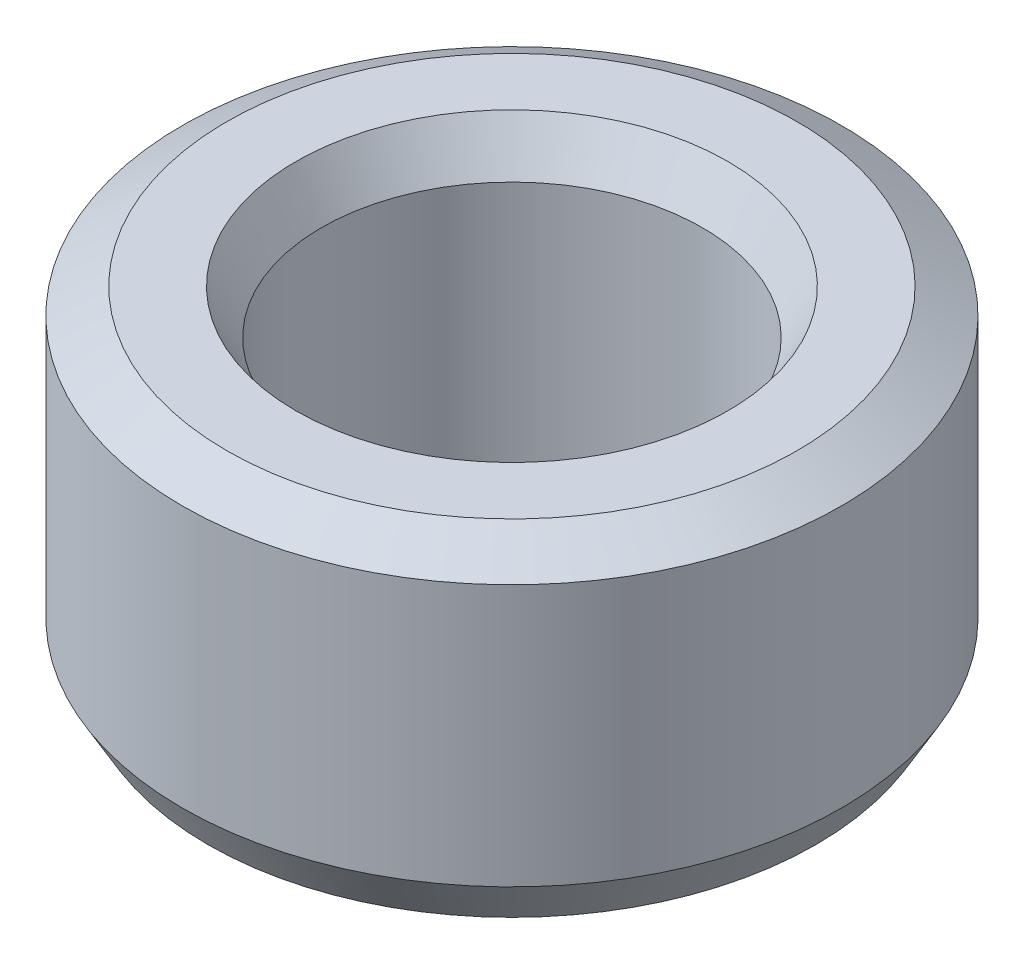
ISO-10303-21;
HEADER;
FILE_DESCRIPTION(('STEP AP214'),'2;1');
FILE_NAME('part.step','',(''),(''),'','','');
FILE_SCHEMA(('AUTOMOTIVE_DESIGN { 1 0 10303 214 1 1 1 1 }'));
ENDSEC;
DATA;
#1=APPLICATION_CONTEXT('core data for automotive mechanical design processes');
#2=APPLICATION_PROTOCOL_DEFINITION('international standard','automotive_design',2000,#1);
#3=PRODUCT_CONTEXT('',#1,'mechanical');
#4=PRODUCT('Part','Part','',(#3));
#5=PRODUCT_RELATED_PRODUCT_CATEGORY('part','',(#4));
#6=PRODUCT_DEFINITION_FORMATION('','',#4);
#7=PRODUCT_DEFINITION_CONTEXT('part definition',#1,'design');
#8=PRODUCT_DEFINITION('design','',#6,#7);
#9=PRODUCT_DEFINITION_SHAPE('','',#8);
#10=(LENGTH_UNIT() NAMED_UNIT(*) SI_UNIT(.MILLI.,.METRE.));
#11=(NAMED_UNIT(*) PLANE_ANGLE_UNIT() SI_UNIT($,.RADIAN.));
#12=(NAMED_UNIT(*) SI_UNIT($,.STERADIAN.) SOLID_ANGLE_UNIT());
#13=UNCERTAINTY_MEASURE_WITH_UNIT(LENGTH_MEASURE(1.E-05),#10,'distance_accuracy_value','');
#14=(GEOMETRIC_REPRESENTATION_CONTEXT(3) GLOBAL_UNCERTAINTY_ASSIGNED_CONTEXT((#13)) GLOBAL_UNIT_ASSIGNED_CONTEXT((#10,
#11,#12)) REPRESENTATION_CONTEXT('',''));
#15=CARTESIAN_POINT('',(0.,0.,0.));
#16=DIRECTION('',(0.,0.,1.));
#17=DIRECTION('',(1.,0.,0.));
#18=AXIS2_PLACEMENT_3D('',#15,#16,#17);
#19=CARTESIAN_POINT('',(0.,27.6772935771259,0.));
#20=DIRECTION('',(0.,-1.,0.));
#21=DIRECTION('',(0.,0.,-1.));
#22=AXIS2_PLACEMENT_3D('',#19,#20,#21);
#23=CYLINDRICAL_SURFACE('',#22,27.5);
#24=CARTESIAN_POINT('',(0.,3.71174707010648,0.));
#25=DIRECTION('',(0.,1.,0.));
#26=DIRECTION('',(0.,0.,1.));
#27=AXIS2_PLACEMENT_3D('',#24,#25,#26);
#28=CIRCLE('',#27,27.5);
#29=CARTESIAN_POINT('',(0.,3.71174707010648,27.5));
#30=VERTEX_POINT('',#29);
#31=EDGE_CURVE('E10',#30,#30,#28,.T.);
#32=ORIENTED_EDGE('',*,*,#31,.T.);
#33=EDGE_LOOP('',(#32));
#34=FACE_BOUND('',#33,.T.);
#35=CARTESIAN_POINT('',(0.,25.5428696094109,0.));
#36=DIRECTION('',(0.,1.,0.));
#37=DIRECTION('',(0.,0.,1.));
#38=AXIS2_PLACEMENT_3D('',#35,#36,#37);
#39=CIRCLE('',#38,27.5);
#40=CARTESIAN_POINT('',(0.,25.5428696094109,27.5));
#41=VERTEX_POINT('',#40);
#42=EDGE_CURVE('E50',#41,#41,#39,.F.);
#43=ORIENTED_EDGE('',*,*,#42,.T.);
#44=EDGE_LOOP('',(#43));
#45=FACE_BOUND('',#44,.T.);
#46=ADVANCED_FACE('F39',(#34,#45),#23,.T.);
#47=CARTESIAN_POINT('',(0.,27.6772935771259,0.));
#48=DIRECTION('',(0.,1.,0.));
#49=DIRECTION('',(0.,0.,1.));
#50=AXIS2_PLACEMENT_3D('',#47,#48,#49);
#51=PLANE('',#50);
#52=CARTESIAN_POINT('',(0.,27.6772935771259,0.));
#53=DIRECTION('',(0.,1.,0.));
#54=DIRECTION('',(0.,0.,1.));
#55=AXIS2_PLACEMENT_3D('',#52,#53,#54);
#56=CIRCLE('',#55,18.0233580995615);
#57=CARTESIAN_POINT('',(0.,27.6772935771259,18.0233580995615));
#58=VERTEX_POINT('',#57);
#59=EDGE_CURVE('E58',#58,#58,#56,.F.);
#60=ORIENTED_EDGE('',*,*,#59,.T.);
#61=EDGE_LOOP('',(#60));
#62=FACE_BOUND('',#61,.T.);
#63=CARTESIAN_POINT('',(0.,27.6772935771259,0.));
#64=DIRECTION('',(0.,1.,0.));
#65=DIRECTION('',(0.,0.,1.));
#66=AXIS2_PLACEMENT_3D('',#63,#64,#65);
#67=CIRCLE('',#66,23.7882529298935);
#68=CARTESIAN_POINT('',(0.,27.6772935771259,23.7882529298935));
#69=VERTEX_POINT('',#68);
#70=EDGE_CURVE('E61',#69,#69,#67,.T.);
#71=ORIENTED_EDGE('',*,*,#70,.T.);
#72=EDGE_LOOP('',(#71));
#73=FACE_BOUND('',#72,.T.);
#74=ADVANCED_FACE('F88',(#62,#73),#51,.T.);
#75=CARTESIAN_POINT('',(0.,0.,0.));
#76=DIRECTION('',(0.,1.,0.));
#77=DIRECTION('',(0.,0.,1.));
#78=AXIS2_PLACEMENT_3D('',#75,#76,#77);
#79=PLANE('',#78);
#80=CARTESIAN_POINT('',(0.,0.,0.));
#81=DIRECTION('',(0.,1.,0.));
#82=DIRECTION('',(0.,0.,1.));
#83=AXIS2_PLACEMENT_3D('',#80,#81,#82);
#84=CIRCLE('',#83,19.6006812019529);
#85=CARTESIAN_POINT('',(0.,0.,19.6006812019529));
#86=VERTEX_POINT('',#85);
#87=EDGE_CURVE('E51',#86,#86,#84,.T.);
#88=ORIENTED_EDGE('',*,*,#87,.T.);
#89=EDGE_LOOP('',(#88));
#90=FACE_BOUND('',#89,.T.);
#91=CARTESIAN_POINT('',(0.,0.,0.));
#92=DIRECTION('',(0.,1.,0.));
#93=DIRECTION('',(0.,0.,1.));
#94=AXIS2_PLACEMENT_3D('',#91,#92,#93);
#95=CIRCLE('',#94,25.365576032285);
#96=CARTESIAN_POINT('',(0.,0.,25.365576032285));
#97=VERTEX_POINT('',#96);
#98=EDGE_CURVE('E54',#97,#97,#95,.F.);
#99=ORIENTED_EDGE('',*,*,#98,.T.);
#100=EDGE_LOOP('',(#99));
#101=FACE_BOUND('',#100,.T.);
#102=ADVANCED_FACE('F83',(#90,#101),#79,.F.);
#103=CARTESIAN_POINT('',(0.,27.6772935771259,0.));
#104=DIRECTION('',(0.,-1.,0.));
#105=DIRECTION('',(0.,0.,-1.));
#106=AXIS2_PLACEMENT_3D('',#103,#104,#105);
#107=CYLINDRICAL_SURFACE('',#106,15.8889341318465);
#108=CARTESIAN_POINT('',(0.,23.9655465070195,0.));
#109=DIRECTION('',(0.,1.,0.));
#110=DIRECTION('',(0.,0.,1.));
#111=AXIS2_PLACEMENT_3D('',#108,#109,#110);
#112=CIRCLE('',#111,15.8889341318465);
#113=CARTESIAN_POINT('',(0.,23.9655465070195,15.8889341318465));
#114=VERTEX_POINT('',#113);
#115=EDGE_CURVE('E67',#114,#114,#112,.T.);
#116=ORIENTED_EDGE('',*,*,#115,.T.);
#117=EDGE_LOOP('',(#116));
#118=FACE_BOUND('',#117,.T.);
#119=CARTESIAN_POINT('',(0.,2.13442396771502,0.));
#120=DIRECTION('',(0.,1.,0.));
#121=DIRECTION('',(0.,0.,1.));
#122=AXIS2_PLACEMENT_3D('',#119,#120,#121);
#123=CIRCLE('',#122,15.8889341318465);
#124=CARTESIAN_POINT('',(0.,2.13442396771502,15.8889341318465));
#125=VERTEX_POINT('',#124);
#126=EDGE_CURVE('E69',#125,#125,#123,.F.);
#127=ORIENTED_EDGE('',*,*,#126,.T.);
#128=EDGE_LOOP('',(#127));
#129=FACE_BOUND('',#128,.T.);
#130=ADVANCED_FACE('F71',(#118,#129),#107,.F.);
#131=CARTESIAN_POINT('',(0.,23.9655465070195,0.));
#132=DIRECTION('',(0.,1.,0.));
#133=DIRECTION('',(0.,0.,1.));
#134=AXIS2_PLACEMENT_3D('',#131,#132,#133);
#135=CONICAL_SURFACE('',#134,15.8889341318465,0.521868578458388);
#136=CARTESIAN_POINT('',(0.,27.6772935771259,18.0233580995615));
#137=CARTESIAN_POINT('',(0.,27.6386295451457,18.0011245165645));
#138=CARTESIAN_POINT('',(0.,27.5999655131654,17.9788909335675));
#139=CARTESIAN_POINT('',(0.,27.5226374492048,17.9344237675734));
#140=CARTESIAN_POINT('',(0.,27.4839734172246,17.9121901845764));
#141=CARTESIAN_POINT('',(0.,27.406645353264,17.8677230185823));
#142=CARTESIAN_POINT('',(0.,27.3679813212837,17.8454894355853));
#143=CARTESIAN_POINT('',(0.,27.2906532573232,17.8010222695912));
#144=CARTESIAN_POINT('',(0.,27.2519892253429,17.7787886865942));
#145=CARTESIAN_POINT('',(0.,27.1746611613823,17.7343215206001));
#146=CARTESIAN_POINT('',(0.,27.1359971294021,17.7120879376031));
#147=CARTESIAN_POINT('',(0.,27.0586690654415,17.667620771609));
#148=CARTESIAN_POINT('',(0.,27.0200050334612,17.645387188612));
#149=CARTESIAN_POINT('',(0.,26.9426769695007,17.6009200226179));
#150=CARTESIAN_POINT('',(0.,26.9040129375204,17.5786864396209));
#151=CARTESIAN_POINT('',(0.,26.8266848735599,17.5342192736268));
#152=CARTESIAN_POINT('',(0.,26.7880208415796,17.5119856906298));
#153=CARTESIAN_POINT('',(0.,26.710692777619,17.4675185246357));
#154=CARTESIAN_POINT('',(0.,26.6720287456388,17.4452849416387));
#155=CARTESIAN_POINT('',(0.,26.5947006816782,17.4008177756446));
#156=CARTESIAN_POINT('',(0.,26.5560366496979,17.3785841926476));
#157=CARTESIAN_POINT('',(0.,26.4787085857374,17.3341170266535));
#158=CARTESIAN_POINT('',(0.,26.4400445537571,17.3118834436565));
#159=CARTESIAN_POINT('',(0.,26.3627164897966,17.2674162776624));
#160=CARTESIAN_POINT('',(0.,26.3240524578163,17.2451826946654));
#161=CARTESIAN_POINT('',(0.,26.2467243938557,17.2007155286714));
#162=CARTESIAN_POINT('',(0.,26.2080603618755,17.1784819456743));
#163=CARTESIAN_POINT('',(0.,26.1307322979149,17.1340147796803));
#164=CARTESIAN_POINT('',(0.,26.0920682659346,17.1117811966832));
#165=CARTESIAN_POINT('',(0.,26.0147402019741,17.0673140306892));
#166=CARTESIAN_POINT('',(0.,25.9760761699938,17.0450804476921));
#167=CARTESIAN_POINT('',(0.,25.8987481060333,17.0006132816981));
#168=CARTESIAN_POINT('',(0.,25.860084074053,16.978379698701));
#169=CARTESIAN_POINT('',(0.,25.7827560100924,16.933912532707));
#170=CARTESIAN_POINT('',(0.,25.7440919781122,16.9116789497099));
#171=CARTESIAN_POINT('',(0.,25.6667639141516,16.8672117837159));
#172=CARTESIAN_POINT('',(0.,25.6280998821713,16.8449782007189));
#173=CARTESIAN_POINT('',(0.,25.5507718182108,16.8005110347248));
#174=CARTESIAN_POINT('',(0.,25.5121077862305,16.7782774517278));
#175=CARTESIAN_POINT('',(0.,25.43477972227,16.7338102857337));
#176=CARTESIAN_POINT('',(0.,25.3961156902897,16.7115767027367));
#177=CARTESIAN_POINT('',(0.,25.3187876263291,16.6671095367426));
#178=CARTESIAN_POINT('',(0.,25.2801235943489,16.6448759537456));
#179=CARTESIAN_POINT('',(0.,25.2027955303883,16.6004087877515));
#180=CARTESIAN_POINT('',(0.,25.164131498408,16.5781752047545));
#181=CARTESIAN_POINT('',(0.,25.0868034344475,16.5337080387604));
#182=CARTESIAN_POINT('',(0.,25.0481394024672,16.5114744557634));
#183=CARTESIAN_POINT('',(0.,24.9708113385066,16.4670072897693));
#184=CARTESIAN_POINT('',(0.,24.9321473065264,16.4447737067723));
#185=CARTESIAN_POINT('',(0.,24.8548192425658,16.4003065407782));
#186=CARTESIAN_POINT('',(0.,24.8161552105855,16.3780729577812));
#187=CARTESIAN_POINT('',(0.,24.738827146625,16.3336057917871));
#188=CARTESIAN_POINT('',(0.,24.7001631146447,16.3113722087901));
#189=CARTESIAN_POINT('',(0.,24.6228350506842,16.266905042796));
#190=CARTESIAN_POINT('',(0.,24.5841710187039,16.244671459799));
#191=CARTESIAN_POINT('',(0.,24.5068429547433,16.2002042938049));
#192=CARTESIAN_POINT('',(0.,24.4681789227631,16.1779707108079));
#193=CARTESIAN_POINT('',(0.,24.3908508588025,16.1335035448138));
#194=CARTESIAN_POINT('',(0.,24.3521868268222,16.1112699618168));
#195=CARTESIAN_POINT('',(0.,24.2748587628617,16.0668027958227));
#196=CARTESIAN_POINT('',(0.,24.2361947308814,16.0445692128257));
#197=CARTESIAN_POINT('',(0.,24.1588666669209,16.0001020468317));
#198=CARTESIAN_POINT('',(0.,24.1202026349406,15.9778684638346));
#199=CARTESIAN_POINT('',(0.,24.04287457098,15.9334012978406));
#200=CARTESIAN_POINT('',(0.,24.0042105389998,15.9111677148435));
#201=CARTESIAN_POINT('',(0.,23.9655465070195,15.8889341318465));
#202=B_SPLINE_CURVE_WITH_KNOTS('',3,(#136,#137,#138,#139,#140,#141,#142,#143,#144,#145,#146,
#147,#148,#149,#150,#151,#152,#153,#154,#155,#156,#157,#158,#159,#160,#161,#162,#163,#164,#165,
#166,#167,#168,#169,#170,#171,#172,#173,#174,#175,#176,#177,#178,#179,#180,#181,#182,#183,#184,
#185,#186,#187,#188,#189,#190,#191,#192,#193,#194,#195,#196,#197,#198,#199,#200,#201),
.UNSPECIFIED.,.F.,.F.,(4,2,2,2,2,2,2,2,2,2,2,2,2,2,2,2,2,2,2,2,2,2,2,2,2,2,2,2,2,2,2,2,4),(0.,
0.133802676493104,0.26760535298621,0.401408029479317,0.535210705972425,0.669013382465529,
0.802816058958636,0.936618735451743,1.07042141194485,1.20422408843795,1.33802676493106,
1.47182944142417,1.60563211791727,1.73943479441038,1.87323747090349,2.00704014739659,
2.1408428238897,2.2746455003828,2.40844817687591,2.54225085336902,2.67605352986212,
2.80985620635523,2.94365888284833,3.07746155934144,3.21126423583455,3.34506691232765,
3.47886958882076,3.61267226531387,3.74647494180697,3.88027761830008,4.01408029479318,
4.14788297128629,4.28168564777939),.UNSPECIFIED.);
#203=EDGE_CURVE('BSEAM77',#58,#114,#202,.T.);
#204=ORIENTED_EDGE('',*,*,#59,.F.);
#205=ORIENTED_EDGE('',*,*,#115,.F.);
#206=ORIENTED_EDGE('',*,*,#203,.T.);
#207=ORIENTED_EDGE('',*,*,#203,.F.);
#208=EDGE_LOOP('',(#204,#206,#205,#207));
#209=FACE_BOUND('',#208,.T.);
#210=ADVANCED_FACE('F77',(#209),#135,.F.);
#211=CARTESIAN_POINT('',(0.,0.,0.));
#212=DIRECTION('',(0.,-1.,0.));
#213=DIRECTION('',(0.,0.,-1.));
#214=AXIS2_PLACEMENT_3D('',#211,#212,#213);
#215=CONICAL_SURFACE('',#214,19.6006812019529,1.04892774833651);
#216=ORIENTED_EDGE('',*,*,#126,.F.);
#217=EDGE_LOOP('',(#216));
#218=FACE_BOUND('',#217,.T.);
#219=ORIENTED_EDGE('',*,*,#87,.F.);
#220=EDGE_LOOP('',(#219));
#221=FACE_BOUND('',#220,.T.);
#222=ADVANCED_FACE('F73',(#218,#221),#215,.F.);
#223=CARTESIAN_POINT('',(0.,3.71174707010648,0.));
#224=DIRECTION('',(0.,1.,0.));
#225=DIRECTION('',(0.,0.,1.));
#226=AXIS2_PLACEMENT_3D('',#223,#224,#225);
#227=CONICAL_SURFACE('',#226,27.5,0.521868578458386);
#228=ORIENTED_EDGE('',*,*,#98,.F.);
#229=EDGE_LOOP('',(#228));
#230=FACE_BOUND('',#229,.T.);
#231=ORIENTED_EDGE('',*,*,#31,.F.);
#232=EDGE_LOOP('',(#231));
#233=FACE_BOUND('',#232,.T.);
#234=ADVANCED_FACE('F76',(#230,#233),#227,.T.);
#235=CARTESIAN_POINT('',(0.,27.6772935771259,0.));
#236=DIRECTION('',(0.,-1.,0.));
#237=DIRECTION('',(0.,0.,-1.));
#238=AXIS2_PLACEMENT_3D('',#235,#236,#237);
#239=CONICAL_SURFACE('',#238,23.7882529298935,1.04892774833651);
#240=ORIENTED_EDGE('',*,*,#42,.F.);
#241=EDGE_LOOP('',(#240));
#242=FACE_BOUND('',#241,.T.);
#243=ORIENTED_EDGE('',*,*,#70,.F.);
#244=EDGE_LOOP('',(#243));
#245=FACE_BOUND('',#244,.T.);
#246=ADVANCED_FACE('F45',(#242,#245),#239,.T.);
#247=CLOSED_SHELL('',(#46,#74,#102,#130,#210,#222,#234,#246));
#248=MANIFOLD_SOLID_BREP('B2',#247);
#249=ADVANCED_BREP_SHAPE_REPRESENTATION('',(#18,#248),#14);
#250=SHAPE_DEFINITION_REPRESENTATION(#9,#249);
ENDSEC;
END-ISO-10303-21;
